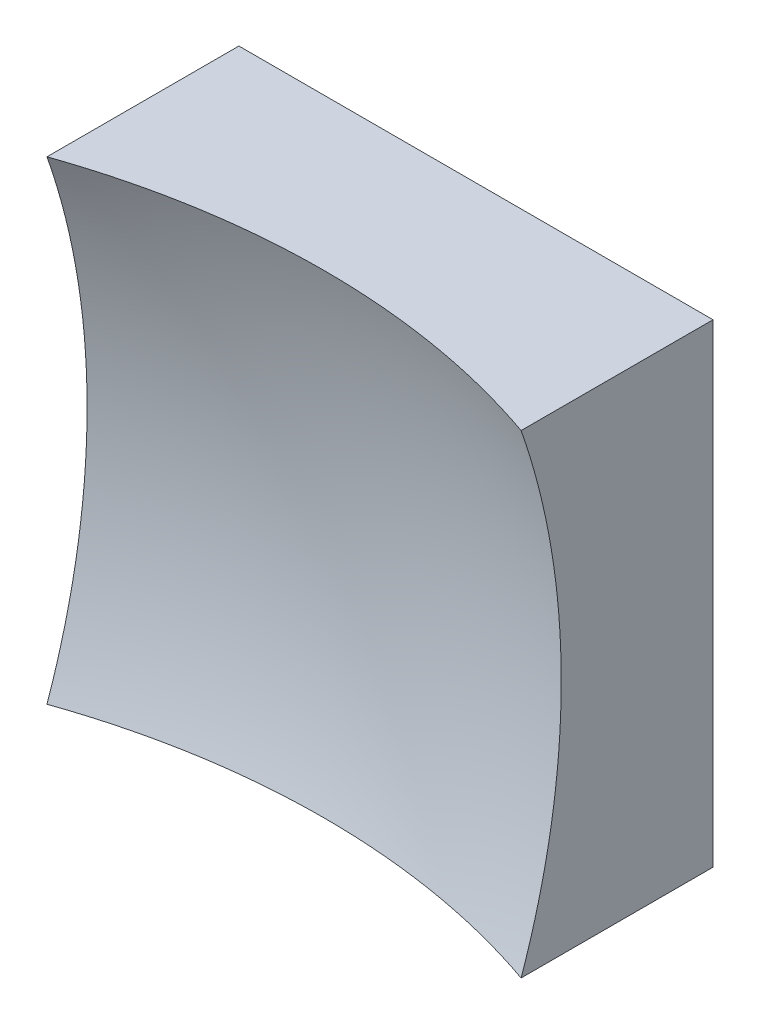
ISO-10303-21;
HEADER;
FILE_DESCRIPTION(('STEP AP214'),'2;1');
FILE_NAME('part.step','',(''),(''),'','','');
FILE_SCHEMA(('AUTOMOTIVE_DESIGN { 1 0 10303 214 1 1 1 1 }'));
ENDSEC;
DATA;
#1=APPLICATION_CONTEXT('core data for automotive mechanical design processes');
#2=APPLICATION_PROTOCOL_DEFINITION('international standard','automotive_design',2000,#1);
#3=PRODUCT_CONTEXT('',#1,'mechanical');
#4=PRODUCT('Part','Part','',(#3));
#5=PRODUCT_RELATED_PRODUCT_CATEGORY('part','',(#4));
#6=PRODUCT_DEFINITION_FORMATION('','',#4);
#7=PRODUCT_DEFINITION_CONTEXT('part definition',#1,'design');
#8=PRODUCT_DEFINITION('design','',#6,#7);
#9=PRODUCT_DEFINITION_SHAPE('','',#8);
#10=(LENGTH_UNIT() NAMED_UNIT(*) SI_UNIT(.MILLI.,.METRE.));
#11=(NAMED_UNIT(*) PLANE_ANGLE_UNIT() SI_UNIT($,.RADIAN.));
#12=(NAMED_UNIT(*) SI_UNIT($,.STERADIAN.) SOLID_ANGLE_UNIT());
#13=UNCERTAINTY_MEASURE_WITH_UNIT(LENGTH_MEASURE(1.E-05),#10,'distance_accuracy_value','');
#14=(GEOMETRIC_REPRESENTATION_CONTEXT(3) GLOBAL_UNCERTAINTY_ASSIGNED_CONTEXT((#13)) GLOBAL_UNIT_ASSIGNED_CONTEXT((#10,
#11,#12)) REPRESENTATION_CONTEXT('',''));
#15=CARTESIAN_POINT('',(0.,0.,0.));
#16=DIRECTION('',(0.,0.,1.));
#17=DIRECTION('',(1.,0.,0.));
#18=AXIS2_PLACEMENT_3D('',#15,#16,#17);
#19=CARTESIAN_POINT('',(-6.25,6.25,10.));
#20=DIRECTION('',(0.,1.,0.));
#21=DIRECTION('',(0.,0.,1.));
#22=AXIS2_PLACEMENT_3D('',#19,#20,#21);
#23=PLANE('',#22);
#24=CARTESIAN_POINT('',(0.,6.25,23.));
#25=DIRECTION('',(0.,1.,0.));
#26=DIRECTION('',(0.,0.,1.));
#27=AXIS2_PLACEMENT_3D('',#24,#25,#26);
#28=CIRCLE('',#27,18.9983551919633);
#29=CARTESIAN_POINT('',(6.25,6.25,5.05912488199084));
#30=VERTEX_POINT('',#29);
#31=CARTESIAN_POINT('',(-6.25,6.25,5.05912488199085));
#32=VERTEX_POINT('',#31);
#33=EDGE_CURVE('E79',#30,#32,#28,.T.);
#34=ORIENTED_EDGE('',*,*,#33,.F.);
#35=DIRECTION('',(0.,0.,-1.));
#36=VECTOR('',#35,1.);
#37=CARTESIAN_POINT('',(6.25,6.25,10.));
#38=LINE('',#37,#36);
#39=CARTESIAN_POINT('',(6.25,6.25,0.));
#40=VERTEX_POINT('',#39);
#41=EDGE_CURVE('E85',#30,#40,#38,.T.);
#42=ORIENTED_EDGE('',*,*,#41,.T.);
#43=DIRECTION('',(1.,0.,0.));
#44=VECTOR('',#43,1.);
#45=CARTESIAN_POINT('',(-6.25,6.25,0.));
#46=LINE('',#45,#44);
#47=CARTESIAN_POINT('',(-6.25,6.25,0.));
#48=VERTEX_POINT('',#47);
#49=EDGE_CURVE('E88',#48,#40,#46,.T.);
#50=ORIENTED_EDGE('',*,*,#49,.F.);
#51=DIRECTION('',(0.,0.,-1.));
#52=VECTOR('',#51,1.);
#53=CARTESIAN_POINT('',(-6.25,6.25,10.));
#54=LINE('',#53,#52);
#55=EDGE_CURVE('E47',#32,#48,#54,.T.);
#56=ORIENTED_EDGE('',*,*,#55,.F.);
#57=EDGE_LOOP('',(#34,#42,#50,#56));
#58=FACE_BOUND('',#57,.T.);
#59=ADVANCED_FACE('F39',(#58),#23,.T.);
#60=CARTESIAN_POINT('',(-6.25,6.25,10.));
#61=DIRECTION('',(1.,0.,0.));
#62=DIRECTION('',(0.,0.,-1.));
#63=AXIS2_PLACEMENT_3D('',#60,#61,#62);
#64=PLANE('',#63);
#65=DIRECTION('',(0.,0.,-1.));
#66=VECTOR('',#65,1.);
#67=CARTESIAN_POINT('',(-6.25,-6.25,10.));
#68=LINE('',#67,#66);
#69=CARTESIAN_POINT('',(-6.25,-6.25,5.05912488199085));
#70=VERTEX_POINT('',#69);
#71=CARTESIAN_POINT('',(-6.25,-6.25,0.));
#72=VERTEX_POINT('',#71);
#73=EDGE_CURVE('E100',#70,#72,#68,.T.);
#74=ORIENTED_EDGE('',*,*,#73,.F.);
#75=CARTESIAN_POINT('',(-6.25,0.,23.));
#76=DIRECTION('',(1.,0.,0.));
#77=DIRECTION('',(0.,0.,-1.));
#78=AXIS2_PLACEMENT_3D('',#75,#76,#77);
#79=CIRCLE('',#78,18.9983551919633);
#80=EDGE_CURVE('E89',#70,#32,#79,.T.);
#81=ORIENTED_EDGE('',*,*,#80,.T.);
#82=ORIENTED_EDGE('',*,*,#55,.T.);
#83=DIRECTION('',(0.,-1.,0.));
#84=VECTOR('',#83,1.);
#85=CARTESIAN_POINT('',(-6.25,6.25,0.));
#86=LINE('',#85,#84);
#87=EDGE_CURVE('E97',#48,#72,#86,.T.);
#88=ORIENTED_EDGE('',*,*,#87,.T.);
#89=EDGE_LOOP('',(#74,#81,#82,#88));
#90=FACE_BOUND('',#89,.T.);
#91=ADVANCED_FACE('F122',(#90),#64,.F.);
#92=CARTESIAN_POINT('',(-6.25,-6.25,10.));
#93=DIRECTION('',(0.,1.,0.));
#94=DIRECTION('',(0.,0.,1.));
#95=AXIS2_PLACEMENT_3D('',#92,#93,#94);
#96=PLANE('',#95);
#97=DIRECTION('',(0.,0.,-1.));
#98=VECTOR('',#97,1.);
#99=CARTESIAN_POINT('',(6.25,-6.25,10.));
#100=LINE('',#99,#98);
#101=CARTESIAN_POINT('',(6.25,-6.25,5.05912488199084));
#102=VERTEX_POINT('',#101);
#103=CARTESIAN_POINT('',(6.25,-6.25,0.));
#104=VERTEX_POINT('',#103);
#105=EDGE_CURVE('E96',#102,#104,#100,.T.);
#106=ORIENTED_EDGE('',*,*,#105,.F.);
#107=CARTESIAN_POINT('',(0.,-6.25,23.));
#108=DIRECTION('',(0.,1.,0.));
#109=DIRECTION('',(0.,0.,1.));
#110=AXIS2_PLACEMENT_3D('',#107,#108,#109);
#111=CIRCLE('',#110,18.9983551919633);
#112=EDGE_CURVE('E53',#102,#70,#111,.T.);
#113=ORIENTED_EDGE('',*,*,#112,.T.);
#114=ORIENTED_EDGE('',*,*,#73,.T.);
#115=DIRECTION('',(1.,0.,0.));
#116=VECTOR('',#115,1.);
#117=CARTESIAN_POINT('',(-6.25,-6.25,0.));
#118=LINE('',#117,#116);
#119=EDGE_CURVE('E102',#72,#104,#118,.T.);
#120=ORIENTED_EDGE('',*,*,#119,.T.);
#121=EDGE_LOOP('',(#106,#113,#114,#120));
#122=FACE_BOUND('',#121,.T.);
#123=ADVANCED_FACE('F121',(#122),#96,.F.);
#124=CARTESIAN_POINT('',(6.25,6.25,10.));
#125=DIRECTION('',(1.,0.,0.));
#126=DIRECTION('',(0.,0.,-1.));
#127=AXIS2_PLACEMENT_3D('',#124,#125,#126);
#128=PLANE('',#127);
#129=CARTESIAN_POINT('',(6.25,0.,23.));
#130=DIRECTION('',(1.,0.,0.));
#131=DIRECTION('',(0.,0.,-1.));
#132=AXIS2_PLACEMENT_3D('',#129,#130,#131);
#133=CIRCLE('',#132,18.9983551919633);
#134=EDGE_CURVE('E11',#102,#30,#133,.T.);
#135=ORIENTED_EDGE('',*,*,#134,.F.);
#136=ORIENTED_EDGE('',*,*,#105,.T.);
#137=DIRECTION('',(0.,-1.,0.));
#138=VECTOR('',#137,1.);
#139=CARTESIAN_POINT('',(6.25,6.25,0.));
#140=LINE('',#139,#138);
#141=EDGE_CURVE('E93',#40,#104,#140,.T.);
#142=ORIENTED_EDGE('',*,*,#141,.F.);
#143=ORIENTED_EDGE('',*,*,#41,.F.);
#144=EDGE_LOOP('',(#135,#136,#142,#143));
#145=FACE_BOUND('',#144,.T.);
#146=ADVANCED_FACE('F91',(#145),#128,.T.);
#147=CARTESIAN_POINT('',(0.,0.,0.));
#148=DIRECTION('',(0.,0.,-1.));
#149=DIRECTION('',(-1.,0.,0.));
#150=AXIS2_PLACEMENT_3D('',#147,#148,#149);
#151=PLANE('',#150);
#152=ORIENTED_EDGE('',*,*,#49,.T.);
#153=ORIENTED_EDGE('',*,*,#141,.T.);
#154=ORIENTED_EDGE('',*,*,#119,.F.);
#155=ORIENTED_EDGE('',*,*,#87,.F.);
#156=EDGE_LOOP('',(#152,#153,#154,#155));
#157=FACE_BOUND('',#156,.T.);
#158=ADVANCED_FACE('F125',(#157),#151,.T.);
#159=CARTESIAN_POINT('',(0.,0.,23.));
#160=DIRECTION('',(0.,0.,1.));
#161=DIRECTION('',(1.,0.,0.));
#162=AXIS2_PLACEMENT_3D('',#159,#160,#161);
#163=SPHERICAL_SURFACE('',#162,20.);
#164=ORIENTED_EDGE('',*,*,#33,.T.);
#165=ORIENTED_EDGE('',*,*,#80,.F.);
#166=ORIENTED_EDGE('',*,*,#112,.F.);
#167=ORIENTED_EDGE('',*,*,#134,.T.);
#168=EDGE_LOOP('',(#164,#165,#166,#167));
#169=FACE_BOUND('',#168,.T.);
#170=ADVANCED_FACE('F78',(#169),#163,.F.);
#171=CLOSED_SHELL('',(#59,#91,#123,#146,#158,#170));
#172=MANIFOLD_SOLID_BREP('B2',#171);
#173=ADVANCED_BREP_SHAPE_REPRESENTATION('',(#18,#172),#14);
#174=SHAPE_DEFINITION_REPRESENTATION(#9,#173);
ENDSEC;
END-ISO-10303-21;
